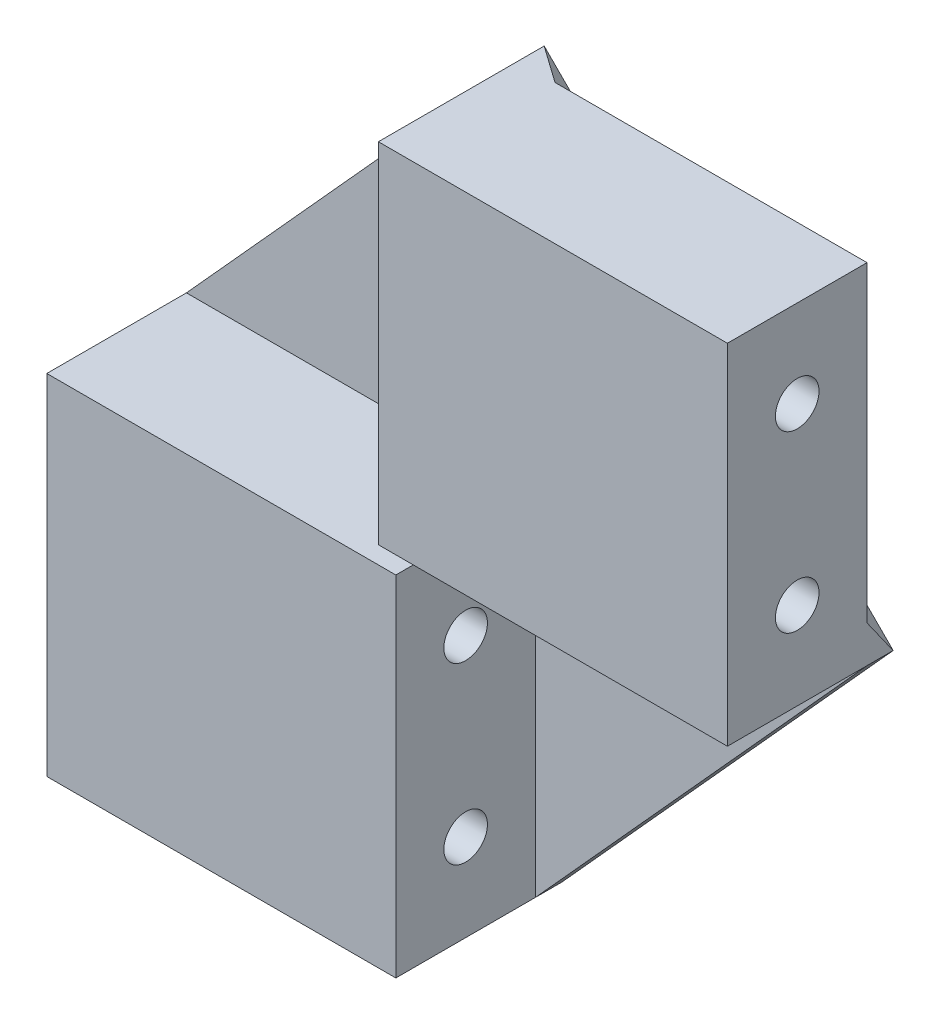
ISO-10303-21;
HEADER;
FILE_DESCRIPTION(('STEP AP214'),'2;1');
FILE_NAME('part.step','',(''),(''),'','','');
FILE_SCHEMA(('AUTOMOTIVE_DESIGN { 1 0 10303 214 1 1 1 1 }'));
ENDSEC;
DATA;
#1=APPLICATION_CONTEXT('core data for automotive mechanical design processes');
#2=APPLICATION_PROTOCOL_DEFINITION('international standard','automotive_design',2000,#1);
#3=PRODUCT_CONTEXT('',#1,'mechanical');
#4=PRODUCT('Part','Part','',(#3));
#5=PRODUCT_RELATED_PRODUCT_CATEGORY('part','',(#4));
#6=PRODUCT_DEFINITION_FORMATION('','',#4);
#7=PRODUCT_DEFINITION_CONTEXT('part definition',#1,'design');
#8=PRODUCT_DEFINITION('design','',#6,#7);
#9=PRODUCT_DEFINITION_SHAPE('','',#8);
#10=(LENGTH_UNIT() NAMED_UNIT(*) SI_UNIT(.MILLI.,.METRE.));
#11=(NAMED_UNIT(*) PLANE_ANGLE_UNIT() SI_UNIT($,.RADIAN.));
#12=(NAMED_UNIT(*) SI_UNIT($,.STERADIAN.) SOLID_ANGLE_UNIT());
#13=UNCERTAINTY_MEASURE_WITH_UNIT(LENGTH_MEASURE(1.E-05),#10,'distance_accuracy_value','');
#14=(GEOMETRIC_REPRESENTATION_CONTEXT(3) GLOBAL_UNCERTAINTY_ASSIGNED_CONTEXT((#13)) GLOBAL_UNIT_ASSIGNED_CONTEXT((#10,
#11,#12)) REPRESENTATION_CONTEXT('',''));
#15=CARTESIAN_POINT('',(0.,0.,0.));
#16=DIRECTION('',(0.,0.,1.));
#17=DIRECTION('',(1.,0.,0.));
#18=AXIS2_PLACEMENT_3D('',#15,#16,#17);
#19=CARTESIAN_POINT('',(0.,20.,-8.));
#20=DIRECTION('',(0.,0.,1.));
#21=DIRECTION('',(-1.,0.,0.));
#22=AXIS2_PLACEMENT_3D('',#19,#20,#21);
#23=PLANE('',#22);
#24=DIRECTION('',(-0.670913323969126,-0.741535779123771,0.));
#25=VECTOR('',#24,1.);
#26=CARTESIAN_POINT('',(-19.,-0.999999999999999,-8.));
#27=LINE('',#26,#25);
#28=CARTESIAN_POINT('',(0.,20.,-8.));
#29=VERTEX_POINT('',#28);
#30=CARTESIAN_POINT('',(-19.,-0.999999999999999,-8.));
#31=VERTEX_POINT('',#30);
#32=EDGE_CURVE('E165',#29,#31,#27,.T.);
#33=ORIENTED_EDGE('',*,*,#32,.T.);
#34=DIRECTION('',(-1.,0.,0.));
#35=VECTOR('',#34,1.);
#36=CARTESIAN_POINT('',(1.,-1.,-8.));
#37=LINE('',#36,#35);
#38=CARTESIAN_POINT('',(1.,-1.,-8.));
#39=VERTEX_POINT('',#38);
#40=EDGE_CURVE('E201',#39,#31,#37,.T.);
#41=ORIENTED_EDGE('',*,*,#40,.F.);
#42=DIRECTION('',(0.,1.,0.));
#43=VECTOR('',#42,1.);
#44=CARTESIAN_POINT('',(1.,-1.,-8.));
#45=LINE('',#44,#43);
#46=CARTESIAN_POINT('',(1.,-21.,-8.));
#47=VERTEX_POINT('',#46);
#48=EDGE_CURVE('E198',#47,#39,#45,.T.);
#49=ORIENTED_EDGE('',*,*,#48,.F.);
#50=DIRECTION('',(0.670913323969126,0.741535779123771,0.));
#51=VECTOR('',#50,1.);
#52=CARTESIAN_POINT('',(1.,-21.,-8.));
#53=LINE('',#52,#51);
#54=CARTESIAN_POINT('',(20.,0.,-8.));
#55=VERTEX_POINT('',#54);
#56=EDGE_CURVE('E168',#47,#55,#53,.T.);
#57=ORIENTED_EDGE('',*,*,#56,.T.);
#58=DIRECTION('',(1.,0.,0.));
#59=VECTOR('',#58,1.);
#60=CARTESIAN_POINT('',(0.,0.,-8.));
#61=LINE('',#60,#59);
#62=CARTESIAN_POINT('',(0.,0.,-8.));
#63=VERTEX_POINT('',#62);
#64=EDGE_CURVE('E142',#63,#55,#61,.T.);
#65=ORIENTED_EDGE('',*,*,#64,.F.);
#66=DIRECTION('',(0.,-1.,0.));
#67=VECTOR('',#66,1.);
#68=CARTESIAN_POINT('',(0.,0.,-8.));
#69=LINE('',#68,#67);
#70=EDGE_CURVE('E158',#29,#63,#69,.T.);
#71=ORIENTED_EDGE('',*,*,#70,.F.);
#72=EDGE_LOOP('',(#33,#41,#49,#57,#65,#71));
#73=FACE_BOUND('',#72,.T.);
#74=ADVANCED_FACE('F37',(#73),#23,.T.);
#75=CARTESIAN_POINT('',(-19.,-21.,-8.));
#76=DIRECTION('',(0.,0.,1.));
#77=DIRECTION('',(-1.,0.,0.));
#78=AXIS2_PLACEMENT_3D('',#75,#76,#77);
#79=PLANE('',#78);
#80=DIRECTION('',(1.,0.,0.));
#81=VECTOR('',#80,1.);
#82=CARTESIAN_POINT('',(1.,-21.,-8.));
#83=LINE('',#82,#81);
#84=CARTESIAN_POINT('',(-19.,-21.,-8.));
#85=VERTEX_POINT('',#84);
#86=CARTESIAN_POINT('',(-1.12132034355963,-21.,-8.));
#87=VERTEX_POINT('',#86);
#88=EDGE_CURVE('E194',#85,#87,#83,.T.);
#89=ORIENTED_EDGE('',*,*,#88,.F.);
#90=DIRECTION('',(0.,-1.,0.));
#91=VECTOR('',#90,1.);
#92=CARTESIAN_POINT('',(-19.,-0.999999999999999,-8.));
#93=LINE('',#92,#91);
#94=CARTESIAN_POINT('',(-19.,-3.12132034355963,-8.));
#95=VERTEX_POINT('',#94);
#96=EDGE_CURVE('E191',#95,#85,#93,.T.);
#97=ORIENTED_EDGE('',*,*,#96,.F.);
#98=DIRECTION('',(-0.707106781186548,0.707106781186547,0.));
#99=VECTOR('',#98,1.);
#100=CARTESIAN_POINT('',(-20.0606601717798,-2.06066017177982,-8.));
#101=LINE('',#100,#99);
#102=EDGE_CURVE('E131',#87,#95,#101,.T.);
#103=ORIENTED_EDGE('',*,*,#102,.F.);
#104=EDGE_LOOP('',(#89,#97,#103));
#105=FACE_BOUND('',#104,.T.);
#106=ADVANCED_FACE('F312',(#105),#79,.F.);
#107=CARTESIAN_POINT('',(-19.,-0.999999999999999,-8.));
#108=DIRECTION('',(1.,0.,0.));
#109=DIRECTION('',(0.,1.,0.));
#110=AXIS2_PLACEMENT_3D('',#107,#108,#109);
#111=PLANE('',#110);
#112=CARTESIAN_POINT('',(-19.,-6.,-4.));
#113=DIRECTION('',(-1.,0.,0.));
#114=DIRECTION('',(0.,0.,1.));
#115=AXIS2_PLACEMENT_3D('',#112,#113,#114);
#116=CIRCLE('',#115,1.24999999999999);
#117=CARTESIAN_POINT('',(-19.,-6.,-2.75));
#118=VERTEX_POINT('',#117);
#119=EDGE_CURVE('E174',#118,#118,#116,.T.);
#120=ORIENTED_EDGE('',*,*,#119,.F.);
#121=EDGE_LOOP('',(#120));
#122=FACE_BOUND('',#121,.T.);
#123=CARTESIAN_POINT('',(-19.,-16.,-3.99999999999999));
#124=DIRECTION('',(-1.,0.,0.));
#125=DIRECTION('',(0.,0.,1.));
#126=AXIS2_PLACEMENT_3D('',#123,#124,#125);
#127=CIRCLE('',#126,1.24999999999999);
#128=CARTESIAN_POINT('',(-19.,-16.,-2.75));
#129=VERTEX_POINT('',#128);
#130=EDGE_CURVE('E184',#129,#129,#127,.T.);
#131=ORIENTED_EDGE('',*,*,#130,.F.);
#132=EDGE_LOOP('',(#131));
#133=FACE_BOUND('',#132,.T.);
#134=DIRECTION('',(0.,-1.,0.));
#135=VECTOR('',#134,1.);
#136=CARTESIAN_POINT('',(-19.,-0.999999999999999,0.));
#137=LINE('',#136,#135);
#138=CARTESIAN_POINT('',(-19.,-0.999999999999999,0.));
#139=VERTEX_POINT('',#138);
#140=CARTESIAN_POINT('',(-19.,-21.,0.));
#141=VERTEX_POINT('',#140);
#142=EDGE_CURVE('E190',#139,#141,#137,.T.);
#143=ORIENTED_EDGE('',*,*,#142,.F.);
#144=DIRECTION('',(0.,0.,1.));
#145=VECTOR('',#144,1.);
#146=CARTESIAN_POINT('',(-19.,-0.999999999999999,-8.));
#147=LINE('',#146,#145);
#148=EDGE_CURVE('E204',#31,#139,#147,.T.);
#149=ORIENTED_EDGE('',*,*,#148,.F.);
#150=DIRECTION('',(0.,0.,-1.));
#151=VECTOR('',#150,1.);
#152=CARTESIAN_POINT('',(-19.,-0.999999999999999,-9.5));
#153=LINE('',#152,#151);
#154=CARTESIAN_POINT('',(-19.,-0.999999999999999,-9.5));
#155=VERTEX_POINT('',#154);
#156=EDGE_CURVE('E233',#31,#155,#153,.T.);
#157=ORIENTED_EDGE('',*,*,#156,.T.);
#158=DIRECTION('',(0.,-0.816496580927723,0.57735026918963));
#159=VECTOR('',#158,1.);
#160=CARTESIAN_POINT('',(-19.,-1.70710678118655,-9.));
#161=LINE('',#160,#159);
#162=EDGE_CURVE('E121',#95,#155,#161,.F.);
#163=ORIENTED_EDGE('',*,*,#162,.F.);
#164=ORIENTED_EDGE('',*,*,#96,.T.);
#165=DIRECTION('',(0.,0.,1.));
#166=VECTOR('',#165,1.);
#167=CARTESIAN_POINT('',(-19.,-21.,-8.));
#168=LINE('',#167,#166);
#169=EDGE_CURVE('E222',#85,#141,#168,.T.);
#170=ORIENTED_EDGE('',*,*,#169,.T.);
#171=EDGE_LOOP('',(#143,#149,#157,#163,#164,#170));
#172=FACE_BOUND('',#171,.T.);
#173=ADVANCED_FACE('F316',(#122,#133,#172),#111,.F.);
#174=CARTESIAN_POINT('',(1.,-21.,-8.));
#175=DIRECTION('',(0.,1.,0.));
#176=DIRECTION('',(-1.,0.,0.));
#177=AXIS2_PLACEMENT_3D('',#174,#175,#176);
#178=PLANE('',#177);
#179=DIRECTION('',(1.,0.,0.));
#180=VECTOR('',#179,1.);
#181=CARTESIAN_POINT('',(1.,-21.,0.));
#182=LINE('',#181,#180);
#183=CARTESIAN_POINT('',(1.,-21.,0.));
#184=VERTEX_POINT('',#183);
#185=EDGE_CURVE('E207',#141,#184,#182,.T.);
#186=ORIENTED_EDGE('',*,*,#185,.F.);
#187=ORIENTED_EDGE('',*,*,#169,.F.);
#188=ORIENTED_EDGE('',*,*,#88,.T.);
#189=DIRECTION('',(0.816496580927723,0.,-0.57735026918963));
#190=VECTOR('',#189,1.);
#191=CARTESIAN_POINT('',(0.292893218813449,-21.,-9.));
#192=LINE('',#191,#190);
#193=CARTESIAN_POINT('',(1.,-21.,-9.50000000000001));
#194=VERTEX_POINT('',#193);
#195=EDGE_CURVE('E130',#194,#87,#192,.F.);
#196=ORIENTED_EDGE('',*,*,#195,.F.);
#197=DIRECTION('',(0.,0.,-1.));
#198=VECTOR('',#197,1.);
#199=CARTESIAN_POINT('',(1.,-21.,-8.));
#200=LINE('',#199,#198);
#201=EDGE_CURVE('E230',#47,#194,#200,.T.);
#202=ORIENTED_EDGE('',*,*,#201,.F.);
#203=DIRECTION('',(0.,0.,1.));
#204=VECTOR('',#203,1.);
#205=CARTESIAN_POINT('',(1.,-21.,-8.));
#206=LINE('',#205,#204);
#207=EDGE_CURVE('E219',#47,#184,#206,.T.);
#208=ORIENTED_EDGE('',*,*,#207,.T.);
#209=EDGE_LOOP('',(#186,#187,#188,#196,#202,#208));
#210=FACE_BOUND('',#209,.T.);
#211=ADVANCED_FACE('F341',(#210),#178,.F.);
#212=CARTESIAN_POINT('',(1.,-1.,-8.));
#213=DIRECTION('',(-1.,0.,0.));
#214=DIRECTION('',(0.,-1.,0.));
#215=AXIS2_PLACEMENT_3D('',#212,#213,#214);
#216=PLANE('',#215);
#217=CARTESIAN_POINT('',(1.,-6.,-4.));
#218=DIRECTION('',(1.,0.,0.));
#219=DIRECTION('',(0.,-1.,0.));
#220=AXIS2_PLACEMENT_3D('',#217,#218,#219);
#221=CIRCLE('',#220,1.24999999999999);
#222=CARTESIAN_POINT('',(1.,-7.24999999999999,-4.));
#223=VERTEX_POINT('',#222);
#224=EDGE_CURVE('E181',#223,#223,#221,.T.);
#225=ORIENTED_EDGE('',*,*,#224,.F.);
#226=EDGE_LOOP('',(#225));
#227=FACE_BOUND('',#226,.T.);
#228=CARTESIAN_POINT('',(1.,-16.,-3.99999999999999));
#229=DIRECTION('',(1.,0.,0.));
#230=DIRECTION('',(0.,-1.,0.));
#231=AXIS2_PLACEMENT_3D('',#228,#229,#230);
#232=CIRCLE('',#231,1.24999999999999);
#233=CARTESIAN_POINT('',(1.,-17.25,-3.99999999999999));
#234=VERTEX_POINT('',#233);
#235=EDGE_CURVE('E187',#234,#234,#232,.T.);
#236=ORIENTED_EDGE('',*,*,#235,.F.);
#237=EDGE_LOOP('',(#236));
#238=FACE_BOUND('',#237,.T.);
#239=DIRECTION('',(0.,1.,0.));
#240=VECTOR('',#239,1.);
#241=CARTESIAN_POINT('',(1.,-1.,0.));
#242=LINE('',#241,#240);
#243=CARTESIAN_POINT('',(1.,-1.,0.));
#244=VERTEX_POINT('',#243);
#245=EDGE_CURVE('E210',#184,#244,#242,.T.);
#246=ORIENTED_EDGE('',*,*,#245,.F.);
#247=ORIENTED_EDGE('',*,*,#207,.F.);
#248=ORIENTED_EDGE('',*,*,#48,.T.);
#249=DIRECTION('',(0.,0.,1.));
#250=VECTOR('',#249,1.);
#251=CARTESIAN_POINT('',(1.,-1.,-8.));
#252=LINE('',#251,#250);
#253=EDGE_CURVE('E216',#39,#244,#252,.T.);
#254=ORIENTED_EDGE('',*,*,#253,.T.);
#255=EDGE_LOOP('',(#246,#247,#248,#254));
#256=FACE_BOUND('',#255,.T.);
#257=ADVANCED_FACE('F337',(#227,#238,#256),#216,.F.);
#258=CARTESIAN_POINT('',(1.,-1.,-8.));
#259=DIRECTION('',(0.,-1.,0.));
#260=DIRECTION('',(1.,0.,0.));
#261=AXIS2_PLACEMENT_3D('',#258,#259,#260);
#262=PLANE('',#261);
#263=DIRECTION('',(-1.,0.,0.));
#264=VECTOR('',#263,1.);
#265=CARTESIAN_POINT('',(1.,-1.,0.));
#266=LINE('',#265,#264);
#267=EDGE_CURVE('E195',#244,#139,#266,.T.);
#268=ORIENTED_EDGE('',*,*,#267,.F.);
#269=ORIENTED_EDGE('',*,*,#253,.F.);
#270=ORIENTED_EDGE('',*,*,#40,.T.);
#271=ORIENTED_EDGE('',*,*,#148,.T.);
#272=EDGE_LOOP('',(#268,#269,#270,#271));
#273=FACE_BOUND('',#272,.T.);
#274=ADVANCED_FACE('F333',(#273),#262,.F.);
#275=CARTESIAN_POINT('',(-19.,-21.,0.));
#276=DIRECTION('',(0.,0.,1.));
#277=DIRECTION('',(-1.,0.,0.));
#278=AXIS2_PLACEMENT_3D('',#275,#276,#277);
#279=PLANE('',#278);
#280=ORIENTED_EDGE('',*,*,#142,.T.);
#281=ORIENTED_EDGE('',*,*,#185,.T.);
#282=ORIENTED_EDGE('',*,*,#245,.T.);
#283=ORIENTED_EDGE('',*,*,#267,.T.);
#284=EDGE_LOOP('',(#280,#281,#282,#283));
#285=FACE_BOUND('',#284,.T.);
#286=ADVANCED_FACE('F328',(#285),#279,.T.);
#287=CARTESIAN_POINT('',(20.,-16.,-3.99999999999999));
#288=DIRECTION('',(1.,0.,0.));
#289=DIRECTION('',(0.,0.,1.));
#290=AXIS2_PLACEMENT_3D('',#287,#288,#289);
#291=CYLINDRICAL_SURFACE('',#290,1.24999999999999);
#292=ORIENTED_EDGE('',*,*,#130,.T.);
#293=EDGE_LOOP('',(#292));
#294=FACE_BOUND('',#293,.T.);
#295=ORIENTED_EDGE('',*,*,#235,.T.);
#296=EDGE_LOOP('',(#295));
#297=FACE_BOUND('',#296,.T.);
#298=ADVANCED_FACE('F325',(#294,#297),#291,.F.);
#299=CARTESIAN_POINT('',(20.,-6.,-4.));
#300=DIRECTION('',(1.,0.,0.));
#301=DIRECTION('',(0.,0.,1.));
#302=AXIS2_PLACEMENT_3D('',#299,#300,#301);
#303=CYLINDRICAL_SURFACE('',#302,1.24999999999999);
#304=ORIENTED_EDGE('',*,*,#119,.T.);
#305=EDGE_LOOP('',(#304));
#306=FACE_BOUND('',#305,.T.);
#307=ORIENTED_EDGE('',*,*,#224,.T.);
#308=EDGE_LOOP('',(#307));
#309=FACE_BOUND('',#308,.T.);
#310=ADVANCED_FACE('F322',(#306,#309),#303,.F.);
#311=CARTESIAN_POINT('',(-19.,-0.999999999999999,-9.5));
#312=DIRECTION('',(0.741535779123771,-0.670913323969126,0.));
#313=DIRECTION('',(0.670913323969126,0.741535779123771,0.));
#314=AXIS2_PLACEMENT_3D('',#311,#312,#313);
#315=PLANE('',#314);
#316=ORIENTED_EDGE('',*,*,#32,.F.);
#317=DIRECTION('',(0.,0.,-1.));
#318=VECTOR('',#317,1.);
#319=CARTESIAN_POINT('',(0.,20.,-8.));
#320=LINE('',#319,#318);
#321=CARTESIAN_POINT('',(0.,20.,-9.50000000000001));
#322=VERTEX_POINT('',#321);
#323=EDGE_CURVE('E45',#29,#322,#320,.T.);
#324=ORIENTED_EDGE('',*,*,#323,.T.);
#325=DIRECTION('',(-0.670913323969126,-0.741535779123771,0.));
#326=VECTOR('',#325,1.);
#327=CARTESIAN_POINT('',(-19.,-0.999999999999999,-9.5));
#328=LINE('',#327,#326);
#329=EDGE_CURVE('E166',#322,#155,#328,.T.);
#330=ORIENTED_EDGE('',*,*,#329,.T.);
#331=ORIENTED_EDGE('',*,*,#156,.F.);
#332=EDGE_LOOP('',(#316,#324,#330,#331));
#333=FACE_BOUND('',#332,.T.);
#334=ADVANCED_FACE('F238',(#333),#315,.F.);
#335=CARTESIAN_POINT('',(1.,-21.,-9.5));
#336=DIRECTION('',(-0.741535779123771,0.670913323969126,0.));
#337=DIRECTION('',(-0.670913323969126,-0.741535779123771,0.));
#338=AXIS2_PLACEMENT_3D('',#335,#336,#337);
#339=PLANE('',#338);
#340=ORIENTED_EDGE('',*,*,#56,.F.);
#341=ORIENTED_EDGE('',*,*,#201,.T.);
#342=DIRECTION('',(0.670913323969126,0.741535779123771,0.));
#343=VECTOR('',#342,1.);
#344=CARTESIAN_POINT('',(1.,-21.,-9.5));
#345=LINE('',#344,#343);
#346=CARTESIAN_POINT('',(20.,0.,-9.5));
#347=VERTEX_POINT('',#346);
#348=EDGE_CURVE('E170',#194,#347,#345,.T.);
#349=ORIENTED_EDGE('',*,*,#348,.T.);
#350=DIRECTION('',(0.,0.,-1.));
#351=VECTOR('',#350,1.);
#352=CARTESIAN_POINT('',(20.,0.,-9.5));
#353=LINE('',#352,#351);
#354=EDGE_CURVE('E11',#55,#347,#353,.T.);
#355=ORIENTED_EDGE('',*,*,#354,.F.);
#356=EDGE_LOOP('',(#340,#341,#349,#355));
#357=FACE_BOUND('',#356,.T.);
#358=ADVANCED_FACE('F298',(#357),#339,.F.);
#359=CARTESIAN_POINT('',(0.,20.,-9.5));
#360=DIRECTION('',(0.,0.,1.));
#361=DIRECTION('',(-1.,0.,0.));
#362=AXIS2_PLACEMENT_3D('',#359,#360,#361);
#363=PLANE('',#362);
#364=ORIENTED_EDGE('',*,*,#329,.F.);
#365=DIRECTION('',(-0.707106781186548,0.707106781186548,0.));
#366=VECTOR('',#365,1.);
#367=CARTESIAN_POINT('',(0.,20.,-9.5));
#368=LINE('',#367,#366);
#369=EDGE_CURVE('E120',#347,#322,#368,.T.);
#370=ORIENTED_EDGE('',*,*,#369,.F.);
#371=ORIENTED_EDGE('',*,*,#348,.F.);
#372=DIRECTION('',(0.707106781186548,-0.707106781186547,0.));
#373=VECTOR('',#372,1.);
#374=CARTESIAN_POINT('',(-19.,-0.999999999999999,-9.5));
#375=LINE('',#374,#373);
#376=EDGE_CURVE('E61',#155,#194,#375,.T.);
#377=ORIENTED_EDGE('',*,*,#376,.F.);
#378=EDGE_LOOP('',(#364,#370,#371,#377));
#379=FACE_BOUND('',#378,.T.);
#380=ADVANCED_FACE('F301',(#379),#363,.F.);
#381=CARTESIAN_POINT('',(0.,20.,-8.));
#382=DIRECTION('',(0.,0.,1.));
#383=DIRECTION('',(-1.,0.,0.));
#384=AXIS2_PLACEMENT_3D('',#381,#382,#383);
#385=PLANE('',#384);
#386=DIRECTION('',(-1.,0.,0.));
#387=VECTOR('',#386,1.);
#388=CARTESIAN_POINT('',(0.,20.,-8.));
#389=LINE('',#388,#387);
#390=CARTESIAN_POINT('',(20.,20.,-8.));
#391=VERTEX_POINT('',#390);
#392=CARTESIAN_POINT('',(2.12132034355963,20.,-8.));
#393=VERTEX_POINT('',#392);
#394=EDGE_CURVE('E127',#391,#393,#389,.T.);
#395=ORIENTED_EDGE('',*,*,#394,.F.);
#396=DIRECTION('',(0.,1.,0.));
#397=VECTOR('',#396,1.);
#398=CARTESIAN_POINT('',(20.,0.,-8.));
#399=LINE('',#398,#397);
#400=CARTESIAN_POINT('',(20.,2.12132034355963,-8.));
#401=VERTEX_POINT('',#400);
#402=EDGE_CURVE('E129',#401,#391,#399,.T.);
#403=ORIENTED_EDGE('',*,*,#402,.F.);
#404=DIRECTION('',(0.707106781186548,-0.707106781186548,0.));
#405=VECTOR('',#404,1.);
#406=CARTESIAN_POINT('',(21.0606601717798,1.06066017177981,-8.));
#407=LINE('',#406,#405);
#408=EDGE_CURVE('E118',#393,#401,#407,.T.);
#409=ORIENTED_EDGE('',*,*,#408,.F.);
#410=EDGE_LOOP('',(#395,#403,#409));
#411=FACE_BOUND('',#410,.T.);
#412=ADVANCED_FACE('F125',(#411),#385,.F.);
#413=CARTESIAN_POINT('',(0.,0.,-8.));
#414=DIRECTION('',(1.,0.,0.));
#415=DIRECTION('',(0.,0.,1.));
#416=AXIS2_PLACEMENT_3D('',#413,#414,#415);
#417=PLANE('',#416);
#418=CARTESIAN_POINT('',(0.,15.,-4.));
#419=DIRECTION('',(-1.,0.,0.));
#420=DIRECTION('',(0.,0.,1.));
#421=AXIS2_PLACEMENT_3D('',#418,#419,#420);
#422=CIRCLE('',#421,1.24999999999999);
#423=CARTESIAN_POINT('',(0.,15.,-2.75000000000001));
#424=VERTEX_POINT('',#423);
#425=EDGE_CURVE('E258',#424,#424,#422,.T.);
#426=ORIENTED_EDGE('',*,*,#425,.F.);
#427=EDGE_LOOP('',(#426));
#428=FACE_BOUND('',#427,.T.);
#429=CARTESIAN_POINT('',(0.,5.,-4.));
#430=DIRECTION('',(-1.,0.,0.));
#431=DIRECTION('',(0.,0.,1.));
#432=AXIS2_PLACEMENT_3D('',#429,#430,#431);
#433=CIRCLE('',#432,1.24999999999999);
#434=CARTESIAN_POINT('',(0.,5.,-2.75000000000001));
#435=VERTEX_POINT('',#434);
#436=EDGE_CURVE('E150',#435,#435,#433,.T.);
#437=ORIENTED_EDGE('',*,*,#436,.F.);
#438=EDGE_LOOP('',(#437));
#439=FACE_BOUND('',#438,.T.);
#440=DIRECTION('',(0.,-1.,0.));
#441=VECTOR('',#440,1.);
#442=CARTESIAN_POINT('',(0.,0.,0.));
#443=LINE('',#442,#441);
#444=CARTESIAN_POINT('',(0.,20.,0.));
#445=VERTEX_POINT('',#444);
#446=CARTESIAN_POINT('',(0.,0.,0.));
#447=VERTEX_POINT('',#446);
#448=EDGE_CURVE('E146',#445,#447,#443,.T.);
#449=ORIENTED_EDGE('',*,*,#448,.F.);
#450=DIRECTION('',(0.,0.,1.));
#451=VECTOR('',#450,1.);
#452=CARTESIAN_POINT('',(0.,20.,-8.));
#453=LINE('',#452,#451);
#454=EDGE_CURVE('E138',#29,#445,#453,.T.);
#455=ORIENTED_EDGE('',*,*,#454,.F.);
#456=ORIENTED_EDGE('',*,*,#70,.T.);
#457=DIRECTION('',(0.,0.,1.));
#458=VECTOR('',#457,1.);
#459=CARTESIAN_POINT('',(0.,0.,-8.));
#460=LINE('',#459,#458);
#461=EDGE_CURVE('E162',#63,#447,#460,.T.);
#462=ORIENTED_EDGE('',*,*,#461,.T.);
#463=EDGE_LOOP('',(#449,#455,#456,#462));
#464=FACE_BOUND('',#463,.T.);
#465=ADVANCED_FACE('F276',(#428,#439,#464),#417,.F.);
#466=CARTESIAN_POINT('',(0.,0.,-8.));
#467=DIRECTION('',(0.,1.,0.));
#468=DIRECTION('',(0.,0.,-1.));
#469=AXIS2_PLACEMENT_3D('',#466,#467,#468);
#470=PLANE('',#469);
#471=DIRECTION('',(1.,0.,0.));
#472=VECTOR('',#471,1.);
#473=CARTESIAN_POINT('',(0.,0.,0.));
#474=LINE('',#473,#472);
#475=CARTESIAN_POINT('',(20.,0.,0.));
#476=VERTEX_POINT('',#475);
#477=EDGE_CURVE('E149',#447,#476,#474,.T.);
#478=ORIENTED_EDGE('',*,*,#477,.F.);
#479=ORIENTED_EDGE('',*,*,#461,.F.);
#480=ORIENTED_EDGE('',*,*,#64,.T.);
#481=DIRECTION('',(0.,0.,1.));
#482=VECTOR('',#481,1.);
#483=CARTESIAN_POINT('',(20.,0.,-8.));
#484=LINE('',#483,#482);
#485=EDGE_CURVE('E88',#55,#476,#484,.T.);
#486=ORIENTED_EDGE('',*,*,#485,.T.);
#487=EDGE_LOOP('',(#478,#479,#480,#486));
#488=FACE_BOUND('',#487,.T.);
#489=ADVANCED_FACE('F279',(#488),#470,.F.);
#490=CARTESIAN_POINT('',(20.,0.,-8.));
#491=DIRECTION('',(-1.,0.,0.));
#492=DIRECTION('',(0.,0.,-1.));
#493=AXIS2_PLACEMENT_3D('',#490,#491,#492);
#494=PLANE('',#493);
#495=CARTESIAN_POINT('',(20.,15.,-4.));
#496=DIRECTION('',(-1.,0.,0.));
#497=DIRECTION('',(0.,0.,1.));
#498=AXIS2_PLACEMENT_3D('',#495,#496,#497);
#499=CIRCLE('',#498,1.24999999999999);
#500=CARTESIAN_POINT('',(20.,15.,-2.75000000000001));
#501=VERTEX_POINT('',#500);
#502=EDGE_CURVE('E261',#501,#501,#499,.T.);
#503=ORIENTED_EDGE('',*,*,#502,.T.);
#504=EDGE_LOOP('',(#503));
#505=FACE_BOUND('',#504,.T.);
#506=CARTESIAN_POINT('',(20.,5.,-4.));
#507=DIRECTION('',(-1.,0.,0.));
#508=DIRECTION('',(0.,0.,1.));
#509=AXIS2_PLACEMENT_3D('',#506,#507,#508);
#510=CIRCLE('',#509,1.24999999999999);
#511=CARTESIAN_POINT('',(20.,5.,-2.75000000000001));
#512=VERTEX_POINT('',#511);
#513=EDGE_CURVE('E255',#512,#512,#510,.T.);
#514=ORIENTED_EDGE('',*,*,#513,.T.);
#515=EDGE_LOOP('',(#514));
#516=FACE_BOUND('',#515,.T.);
#517=DIRECTION('',(0.,1.,0.));
#518=VECTOR('',#517,1.);
#519=CARTESIAN_POINT('',(20.,0.,0.));
#520=LINE('',#519,#518);
#521=CARTESIAN_POINT('',(20.,20.,0.));
#522=VERTEX_POINT('',#521);
#523=EDGE_CURVE('E153',#476,#522,#520,.T.);
#524=ORIENTED_EDGE('',*,*,#523,.F.);
#525=ORIENTED_EDGE('',*,*,#485,.F.);
#526=ORIENTED_EDGE('',*,*,#354,.T.);
#527=DIRECTION('',(0.,0.816496580927723,0.577350269189631));
#528=VECTOR('',#527,1.);
#529=CARTESIAN_POINT('',(20.,0.707106781186554,-9.));
#530=LINE('',#529,#528);
#531=EDGE_CURVE('E52',#401,#347,#530,.F.);
#532=ORIENTED_EDGE('',*,*,#531,.F.);
#533=ORIENTED_EDGE('',*,*,#402,.T.);
#534=DIRECTION('',(0.,0.,1.));
#535=VECTOR('',#534,1.);
#536=CARTESIAN_POINT('',(20.,20.,-8.));
#537=LINE('',#536,#535);
#538=EDGE_CURVE('E137',#391,#522,#537,.T.);
#539=ORIENTED_EDGE('',*,*,#538,.T.);
#540=EDGE_LOOP('',(#524,#525,#526,#532,#533,#539));
#541=FACE_BOUND('',#540,.T.);
#542=ADVANCED_FACE('F265',(#505,#516,#541),#494,.F.);
#543=CARTESIAN_POINT('',(0.,20.,-8.));
#544=DIRECTION('',(0.,-1.,0.));
#545=DIRECTION('',(0.,0.,1.));
#546=AXIS2_PLACEMENT_3D('',#543,#544,#545);
#547=PLANE('',#546);
#548=DIRECTION('',(-1.,0.,0.));
#549=VECTOR('',#548,1.);
#550=CARTESIAN_POINT('',(0.,20.,0.));
#551=LINE('',#550,#549);
#552=EDGE_CURVE('E156',#522,#445,#551,.T.);
#553=ORIENTED_EDGE('',*,*,#552,.F.);
#554=ORIENTED_EDGE('',*,*,#538,.F.);
#555=ORIENTED_EDGE('',*,*,#394,.T.);
#556=DIRECTION('',(-0.816496580927723,0.,-0.577350269189631));
#557=VECTOR('',#556,1.);
#558=CARTESIAN_POINT('',(0.707106781186554,20.,-9.));
#559=LINE('',#558,#557);
#560=EDGE_CURVE('E74',#322,#393,#559,.F.);
#561=ORIENTED_EDGE('',*,*,#560,.F.);
#562=ORIENTED_EDGE('',*,*,#323,.F.);
#563=ORIENTED_EDGE('',*,*,#454,.T.);
#564=EDGE_LOOP('',(#553,#554,#555,#561,#562,#563));
#565=FACE_BOUND('',#564,.T.);
#566=ADVANCED_FACE('F135',(#565),#547,.F.);
#567=CARTESIAN_POINT('',(0.,20.,0.));
#568=DIRECTION('',(0.,0.,1.));
#569=DIRECTION('',(-1.,0.,0.));
#570=AXIS2_PLACEMENT_3D('',#567,#568,#569);
#571=PLANE('',#570);
#572=ORIENTED_EDGE('',*,*,#448,.T.);
#573=ORIENTED_EDGE('',*,*,#477,.T.);
#574=ORIENTED_EDGE('',*,*,#523,.T.);
#575=ORIENTED_EDGE('',*,*,#552,.T.);
#576=EDGE_LOOP('',(#572,#573,#574,#575));
#577=FACE_BOUND('',#576,.T.);
#578=ADVANCED_FACE('F286',(#577),#571,.T.);
#579=CARTESIAN_POINT('',(20.,5.,-4.));
#580=DIRECTION('',(1.,0.,0.));
#581=DIRECTION('',(0.,0.,1.));
#582=AXIS2_PLACEMENT_3D('',#579,#580,#581);
#583=CYLINDRICAL_SURFACE('',#582,1.24999999999999);
#584=ORIENTED_EDGE('',*,*,#513,.F.);
#585=EDGE_LOOP('',(#584));
#586=FACE_BOUND('',#585,.T.);
#587=ORIENTED_EDGE('',*,*,#436,.T.);
#588=EDGE_LOOP('',(#587));
#589=FACE_BOUND('',#588,.T.);
#590=ADVANCED_FACE('F272',(#586,#589),#583,.F.);
#591=CARTESIAN_POINT('',(20.,15.,-4.));
#592=DIRECTION('',(1.,0.,0.));
#593=DIRECTION('',(0.,0.,1.));
#594=AXIS2_PLACEMENT_3D('',#591,#592,#593);
#595=CYLINDRICAL_SURFACE('',#594,1.24999999999999);
#596=ORIENTED_EDGE('',*,*,#502,.F.);
#597=EDGE_LOOP('',(#596));
#598=FACE_BOUND('',#597,.T.);
#599=ORIENTED_EDGE('',*,*,#425,.T.);
#600=EDGE_LOOP('',(#599));
#601=FACE_BOUND('',#600,.T.);
#602=ADVANCED_FACE('F268',(#598,#601),#595,.F.);
#603=CARTESIAN_POINT('',(-19.,-0.999999999999999,-9.50000000000001));
#604=DIRECTION('',(-0.500000000000003,-0.500000000000003,-0.707106781186544));
#605=DIRECTION('',(0.,-0.816496580927723,0.57735026918963));
#606=AXIS2_PLACEMENT_3D('',#603,#604,#605);
#607=PLANE('',#606);
#608=ORIENTED_EDGE('',*,*,#162,.T.);
#609=ORIENTED_EDGE('',*,*,#376,.T.);
#610=ORIENTED_EDGE('',*,*,#195,.T.);
#611=ORIENTED_EDGE('',*,*,#102,.T.);
#612=EDGE_LOOP('',(#608,#609,#610,#611));
#613=FACE_BOUND('',#612,.T.);
#614=ADVANCED_FACE('F271',(#613),#607,.T.);
#615=CARTESIAN_POINT('',(0.,20.,-9.50000000000001));
#616=DIRECTION('',(0.500000000000003,0.500000000000003,-0.707106781186543));
#617=DIRECTION('',(0.816496580927723,0.,0.577350269189631));
#618=AXIS2_PLACEMENT_3D('',#615,#616,#617);
#619=PLANE('',#618);
#620=ORIENTED_EDGE('',*,*,#531,.T.);
#621=ORIENTED_EDGE('',*,*,#369,.T.);
#622=ORIENTED_EDGE('',*,*,#560,.T.);
#623=ORIENTED_EDGE('',*,*,#408,.T.);
#624=EDGE_LOOP('',(#620,#621,#622,#623));
#625=FACE_BOUND('',#624,.T.);
#626=ADVANCED_FACE('F39',(#625),#619,.T.);
#627=CLOSED_SHELL('',(#74,#106,#173,#211,#257,#274,#286,#298,#310,#334,#358,#380,#412,#465,#489,
#542,#566,#578,#590,#602,#614,#626));
#628=MANIFOLD_SOLID_BREP('B2',#627);
#629=ADVANCED_BREP_SHAPE_REPRESENTATION('',(#18,#628),#14);
#630=SHAPE_DEFINITION_REPRESENTATION(#9,#629);
ENDSEC;
END-ISO-10303-21;
